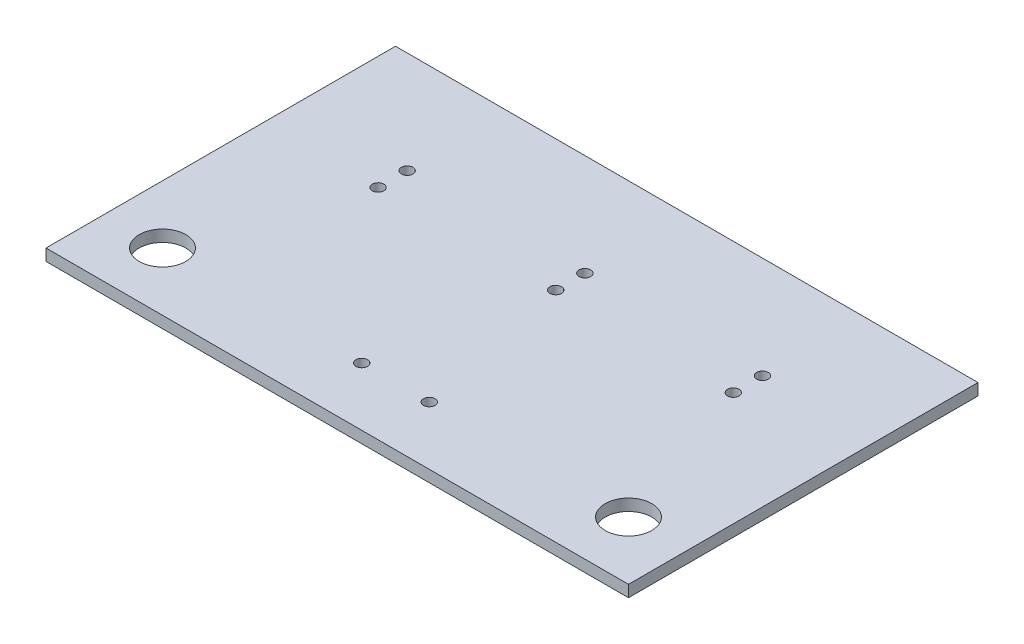
ISO-10303-21;
HEADER;
FILE_DESCRIPTION(('STEP AP214'),'2;1');
FILE_NAME('part.step','',(''),(''),'','','');
FILE_SCHEMA(('AUTOMOTIVE_DESIGN { 1 0 10303 214 1 1 1 1 }'));
ENDSEC;
DATA;
#1=APPLICATION_CONTEXT('core data for automotive mechanical design processes');
#2=APPLICATION_PROTOCOL_DEFINITION('international standard','automotive_design',2000,#1);
#3=PRODUCT_CONTEXT('',#1,'mechanical');
#4=PRODUCT('Part','Part','',(#3));
#5=PRODUCT_RELATED_PRODUCT_CATEGORY('part','',(#4));
#6=PRODUCT_DEFINITION_FORMATION('','',#4);
#7=PRODUCT_DEFINITION_CONTEXT('part definition',#1,'design');
#8=PRODUCT_DEFINITION('design','',#6,#7);
#9=PRODUCT_DEFINITION_SHAPE('','',#8);
#10=(LENGTH_UNIT() NAMED_UNIT(*) SI_UNIT(.MILLI.,.METRE.));
#11=(NAMED_UNIT(*) PLANE_ANGLE_UNIT() SI_UNIT($,.RADIAN.));
#12=(NAMED_UNIT(*) SI_UNIT($,.STERADIAN.) SOLID_ANGLE_UNIT());
#13=UNCERTAINTY_MEASURE_WITH_UNIT(LENGTH_MEASURE(1.E-05),#10,'distance_accuracy_value','');
#14=(GEOMETRIC_REPRESENTATION_CONTEXT(3) GLOBAL_UNCERTAINTY_ASSIGNED_CONTEXT((#13)) GLOBAL_UNIT_ASSIGNED_CONTEXT((#10,
#11,#12)) REPRESENTATION_CONTEXT('',''));
#15=CARTESIAN_POINT('',(0.,0.,0.));
#16=DIRECTION('',(0.,0.,1.));
#17=DIRECTION('',(1.,0.,0.));
#18=AXIS2_PLACEMENT_3D('',#15,#16,#17);
#19=CARTESIAN_POINT('',(0.,1.,0.));
#20=DIRECTION('',(1.,0.,0.));
#21=DIRECTION('',(0.,0.,-1.));
#22=AXIS2_PLACEMENT_3D('',#19,#20,#21);
#23=PLANE('',#22);
#24=DIRECTION('',(0.,0.,1.));
#25=VECTOR('',#24,1.);
#26=CARTESIAN_POINT('',(0.,0.,0.));
#27=LINE('',#26,#25);
#28=CARTESIAN_POINT('',(0.,0.,-30.));
#29=VERTEX_POINT('',#28);
#30=CARTESIAN_POINT('',(0.,0.,0.));
#31=VERTEX_POINT('',#30);
#32=EDGE_CURVE('E95',#29,#31,#27,.T.);
#33=ORIENTED_EDGE('',*,*,#32,.T.);
#34=DIRECTION('',(0.,-1.,0.));
#35=VECTOR('',#34,1.);
#36=CARTESIAN_POINT('',(0.,1.,0.));
#37=LINE('',#36,#35);
#38=CARTESIAN_POINT('',(0.,1.,0.));
#39=VERTEX_POINT('',#38);
#40=EDGE_CURVE('E11',#39,#31,#37,.T.);
#41=ORIENTED_EDGE('',*,*,#40,.F.);
#42=DIRECTION('',(0.,0.,1.));
#43=VECTOR('',#42,1.);
#44=CARTESIAN_POINT('',(0.,1.,0.));
#45=LINE('',#44,#43);
#46=CARTESIAN_POINT('',(0.,1.,-30.));
#47=VERTEX_POINT('',#46);
#48=EDGE_CURVE('E83',#47,#39,#45,.T.);
#49=ORIENTED_EDGE('',*,*,#48,.F.);
#50=DIRECTION('',(0.,-1.,0.));
#51=VECTOR('',#50,1.);
#52=CARTESIAN_POINT('',(0.,1.,-30.));
#53=LINE('',#52,#51);
#54=EDGE_CURVE('E91',#47,#29,#53,.T.);
#55=ORIENTED_EDGE('',*,*,#54,.T.);
#56=EDGE_LOOP('',(#33,#41,#49,#55));
#57=FACE_BOUND('',#56,.T.);
#58=ADVANCED_FACE('F32',(#57),#23,.F.);
#59=CARTESIAN_POINT('',(0.,1.,0.));
#60=DIRECTION('',(0.,0.,-1.));
#61=DIRECTION('',(-1.,0.,0.));
#62=AXIS2_PLACEMENT_3D('',#59,#60,#61);
#63=PLANE('',#62);
#64=DIRECTION('',(1.,0.,0.));
#65=VECTOR('',#64,1.);
#66=CARTESIAN_POINT('',(0.,0.,0.));
#67=LINE('',#66,#65);
#68=CARTESIAN_POINT('',(50.,0.,0.));
#69=VERTEX_POINT('',#68);
#70=EDGE_CURVE('E87',#31,#69,#67,.T.);
#71=ORIENTED_EDGE('',*,*,#70,.T.);
#72=DIRECTION('',(0.,-1.,0.));
#73=VECTOR('',#72,1.);
#74=CARTESIAN_POINT('',(50.,1.,0.));
#75=LINE('',#74,#73);
#76=CARTESIAN_POINT('',(50.,1.,0.));
#77=VERTEX_POINT('',#76);
#78=EDGE_CURVE('E40',#77,#69,#75,.T.);
#79=ORIENTED_EDGE('',*,*,#78,.F.);
#80=DIRECTION('',(1.,0.,0.));
#81=VECTOR('',#80,1.);
#82=CARTESIAN_POINT('',(0.,1.,0.));
#83=LINE('',#82,#81);
#84=EDGE_CURVE('E78',#39,#77,#83,.T.);
#85=ORIENTED_EDGE('',*,*,#84,.F.);
#86=ORIENTED_EDGE('',*,*,#40,.T.);
#87=EDGE_LOOP('',(#71,#79,#85,#86));
#88=FACE_BOUND('',#87,.T.);
#89=ADVANCED_FACE('F86',(#88),#63,.F.);
#90=CARTESIAN_POINT('',(50.,1.,0.));
#91=DIRECTION('',(-1.,0.,0.));
#92=DIRECTION('',(0.,0.,1.));
#93=AXIS2_PLACEMENT_3D('',#90,#91,#92);
#94=PLANE('',#93);
#95=DIRECTION('',(0.,0.,-1.));
#96=VECTOR('',#95,1.);
#97=CARTESIAN_POINT('',(50.,0.,0.));
#98=LINE('',#97,#96);
#99=CARTESIAN_POINT('',(50.,0.,-30.));
#100=VERTEX_POINT('',#99);
#101=EDGE_CURVE('E65',#69,#100,#98,.T.);
#102=ORIENTED_EDGE('',*,*,#101,.T.);
#103=DIRECTION('',(0.,-1.,0.));
#104=VECTOR('',#103,1.);
#105=CARTESIAN_POINT('',(50.,1.,-30.));
#106=LINE('',#105,#104);
#107=CARTESIAN_POINT('',(50.,1.,-30.));
#108=VERTEX_POINT('',#107);
#109=EDGE_CURVE('E88',#108,#100,#106,.T.);
#110=ORIENTED_EDGE('',*,*,#109,.F.);
#111=DIRECTION('',(0.,0.,-1.));
#112=VECTOR('',#111,1.);
#113=CARTESIAN_POINT('',(50.,1.,0.));
#114=LINE('',#113,#112);
#115=EDGE_CURVE('E81',#77,#108,#114,.T.);
#116=ORIENTED_EDGE('',*,*,#115,.F.);
#117=ORIENTED_EDGE('',*,*,#78,.T.);
#118=EDGE_LOOP('',(#102,#110,#116,#117));
#119=FACE_BOUND('',#118,.T.);
#120=ADVANCED_FACE('F89',(#119),#94,.F.);
#121=CARTESIAN_POINT('',(0.,1.,-30.));
#122=DIRECTION('',(0.,0.,1.));
#123=DIRECTION('',(1.,0.,0.));
#124=AXIS2_PLACEMENT_3D('',#121,#122,#123);
#125=PLANE('',#124);
#126=DIRECTION('',(-1.,0.,0.));
#127=VECTOR('',#126,1.);
#128=CARTESIAN_POINT('',(0.,0.,-30.));
#129=LINE('',#128,#127);
#130=EDGE_CURVE('E71',#100,#29,#129,.T.);
#131=ORIENTED_EDGE('',*,*,#130,.T.);
#132=ORIENTED_EDGE('',*,*,#54,.F.);
#133=DIRECTION('',(-1.,0.,0.));
#134=VECTOR('',#133,1.);
#135=CARTESIAN_POINT('',(0.,1.,-30.));
#136=LINE('',#135,#134);
#137=EDGE_CURVE('E48',#108,#47,#136,.T.);
#138=ORIENTED_EDGE('',*,*,#137,.F.);
#139=ORIENTED_EDGE('',*,*,#109,.T.);
#140=EDGE_LOOP('',(#131,#132,#138,#139));
#141=FACE_BOUND('',#140,.T.);
#142=ADVANCED_FACE('F103',(#141),#125,.F.);
#143=CARTESIAN_POINT('',(0.,1.,0.));
#144=DIRECTION('',(0.,-1.,0.));
#145=DIRECTION('',(0.,0.,-1.));
#146=AXIS2_PLACEMENT_3D('',#143,#144,#145);
#147=PLANE('',#146);
#148=CARTESIAN_POINT('',(5.,1.,-5.));
#149=DIRECTION('',(0.,1.,0.));
#150=DIRECTION('',(0.,0.,1.));
#151=AXIS2_PLACEMENT_3D('',#148,#149,#150);
#152=CIRCLE('',#151,2.);
#153=CARTESIAN_POINT('',(5.,1.,-3.));
#154=VERTEX_POINT('',#153);
#155=EDGE_CURVE('E163',#154,#154,#152,.T.);
#156=ORIENTED_EDGE('',*,*,#155,.F.);
#157=EDGE_LOOP('',(#156));
#158=FACE_BOUND('',#157,.T.);
#159=CARTESIAN_POINT('',(45.,1.,-5.));
#160=DIRECTION('',(0.,1.,0.));
#161=DIRECTION('',(0.,0.,1.));
#162=AXIS2_PLACEMENT_3D('',#159,#160,#161);
#163=CIRCLE('',#162,2.);
#164=CARTESIAN_POINT('',(45.,1.,-3.));
#165=VERTEX_POINT('',#164);
#166=EDGE_CURVE('E157',#165,#165,#163,.T.);
#167=ORIENTED_EDGE('',*,*,#166,.F.);
#168=EDGE_LOOP('',(#167));
#169=FACE_BOUND('',#168,.T.);
#170=CARTESIAN_POINT('',(40.25,1.,-21.25));
#171=DIRECTION('',(0.,1.,0.));
#172=DIRECTION('',(0.,0.,1.));
#173=AXIS2_PLACEMENT_3D('',#170,#171,#172);
#174=CIRCLE('',#173,0.499999999999999);
#175=CARTESIAN_POINT('',(40.25,1.,-20.75));
#176=VERTEX_POINT('',#175);
#177=EDGE_CURVE('E151',#176,#176,#174,.T.);
#178=ORIENTED_EDGE('',*,*,#177,.F.);
#179=EDGE_LOOP('',(#178));
#180=FACE_BOUND('',#179,.T.);
#181=CARTESIAN_POINT('',(40.25,1.,-18.75));
#182=DIRECTION('',(0.,1.,0.));
#183=DIRECTION('',(0.,0.,1.));
#184=AXIS2_PLACEMENT_3D('',#181,#182,#183);
#185=CIRCLE('',#184,0.499999999999999);
#186=CARTESIAN_POINT('',(40.25,1.,-18.25));
#187=VERTEX_POINT('',#186);
#188=EDGE_CURVE('E145',#187,#187,#185,.T.);
#189=ORIENTED_EDGE('',*,*,#188,.F.);
#190=EDGE_LOOP('',(#189));
#191=FACE_BOUND('',#190,.T.);
#192=CARTESIAN_POINT('',(25.,1.,-21.25));
#193=DIRECTION('',(0.,1.,0.));
#194=DIRECTION('',(0.,0.,1.));
#195=AXIS2_PLACEMENT_3D('',#192,#193,#194);
#196=CIRCLE('',#195,0.499999999999999);
#197=CARTESIAN_POINT('',(25.,1.,-20.75));
#198=VERTEX_POINT('',#197);
#199=EDGE_CURVE('E139',#198,#198,#196,.T.);
#200=ORIENTED_EDGE('',*,*,#199,.F.);
#201=EDGE_LOOP('',(#200));
#202=FACE_BOUND('',#201,.T.);
#203=CARTESIAN_POINT('',(25.,1.,-18.75));
#204=DIRECTION('',(0.,1.,0.));
#205=DIRECTION('',(0.,0.,1.));
#206=AXIS2_PLACEMENT_3D('',#203,#204,#205);
#207=CIRCLE('',#206,0.499999999999999);
#208=CARTESIAN_POINT('',(25.,1.,-18.25));
#209=VERTEX_POINT('',#208);
#210=EDGE_CURVE('E133',#209,#209,#207,.T.);
#211=ORIENTED_EDGE('',*,*,#210,.F.);
#212=EDGE_LOOP('',(#211));
#213=FACE_BOUND('',#212,.T.);
#214=CARTESIAN_POINT('',(9.75,1.,-21.25));
#215=DIRECTION('',(0.,1.,0.));
#216=DIRECTION('',(0.,0.,1.));
#217=AXIS2_PLACEMENT_3D('',#214,#215,#216);
#218=CIRCLE('',#217,0.500000000000001);
#219=CARTESIAN_POINT('',(9.75,1.,-20.75));
#220=VERTEX_POINT('',#219);
#221=EDGE_CURVE('E127',#220,#220,#218,.T.);
#222=ORIENTED_EDGE('',*,*,#221,.F.);
#223=EDGE_LOOP('',(#222));
#224=FACE_BOUND('',#223,.T.);
#225=CARTESIAN_POINT('',(9.75,1.,-18.75));
#226=DIRECTION('',(0.,1.,0.));
#227=DIRECTION('',(0.,0.,1.));
#228=AXIS2_PLACEMENT_3D('',#225,#226,#227);
#229=CIRCLE('',#228,0.500000000000001);
#230=CARTESIAN_POINT('',(9.75,1.,-18.25));
#231=VERTEX_POINT('',#230);
#232=EDGE_CURVE('E121',#231,#231,#229,.T.);
#233=ORIENTED_EDGE('',*,*,#232,.F.);
#234=EDGE_LOOP('',(#233));
#235=FACE_BOUND('',#234,.T.);
#236=CARTESIAN_POINT('',(27.9,1.,-5.));
#237=DIRECTION('',(0.,1.,0.));
#238=DIRECTION('',(0.,0.,1.));
#239=AXIS2_PLACEMENT_3D('',#236,#237,#238);
#240=CIRCLE('',#239,0.499999999999999);
#241=CARTESIAN_POINT('',(27.9,1.,-4.5));
#242=VERTEX_POINT('',#241);
#243=EDGE_CURVE('E115',#242,#242,#240,.T.);
#244=ORIENTED_EDGE('',*,*,#243,.F.);
#245=EDGE_LOOP('',(#244));
#246=FACE_BOUND('',#245,.T.);
#247=CARTESIAN_POINT('',(22.1,1.,-5.));
#248=DIRECTION('',(0.,1.,0.));
#249=DIRECTION('',(0.,0.,1.));
#250=AXIS2_PLACEMENT_3D('',#247,#248,#249);
#251=CIRCLE('',#250,0.499999999999999);
#252=CARTESIAN_POINT('',(22.1,1.,-4.5));
#253=VERTEX_POINT('',#252);
#254=EDGE_CURVE('E109',#253,#253,#251,.T.);
#255=ORIENTED_EDGE('',*,*,#254,.F.);
#256=EDGE_LOOP('',(#255));
#257=FACE_BOUND('',#256,.T.);
#258=ORIENTED_EDGE('',*,*,#48,.T.);
#259=ORIENTED_EDGE('',*,*,#84,.T.);
#260=ORIENTED_EDGE('',*,*,#115,.T.);
#261=ORIENTED_EDGE('',*,*,#137,.T.);
#262=EDGE_LOOP('',(#258,#259,#260,#261));
#263=FACE_BOUND('',#262,.T.);
#264=ADVANCED_FACE('F79',(#158,#169,#180,#191,#202,#213,#224,#235,#246,#257,#263),#147,.F.);
#265=CARTESIAN_POINT('',(0.,0.,0.));
#266=DIRECTION('',(0.,-1.,0.));
#267=DIRECTION('',(0.,0.,-1.));
#268=AXIS2_PLACEMENT_3D('',#265,#266,#267);
#269=PLANE('',#268);
#270=CARTESIAN_POINT('',(5.,0.,-5.));
#271=DIRECTION('',(0.,1.,0.));
#272=DIRECTION('',(0.,0.,1.));
#273=AXIS2_PLACEMENT_3D('',#270,#271,#272);
#274=CIRCLE('',#273,2.);
#275=CARTESIAN_POINT('',(5.,0.,-3.));
#276=VERTEX_POINT('',#275);
#277=EDGE_CURVE('E160',#276,#276,#274,.T.);
#278=ORIENTED_EDGE('',*,*,#277,.T.);
#279=EDGE_LOOP('',(#278));
#280=FACE_BOUND('',#279,.T.);
#281=CARTESIAN_POINT('',(45.,0.,-5.));
#282=DIRECTION('',(0.,1.,0.));
#283=DIRECTION('',(0.,0.,1.));
#284=AXIS2_PLACEMENT_3D('',#281,#282,#283);
#285=CIRCLE('',#284,2.);
#286=CARTESIAN_POINT('',(45.,0.,-3.));
#287=VERTEX_POINT('',#286);
#288=EDGE_CURVE('E154',#287,#287,#285,.T.);
#289=ORIENTED_EDGE('',*,*,#288,.T.);
#290=EDGE_LOOP('',(#289));
#291=FACE_BOUND('',#290,.T.);
#292=CARTESIAN_POINT('',(40.25,0.,-21.25));
#293=DIRECTION('',(0.,1.,0.));
#294=DIRECTION('',(0.,0.,1.));
#295=AXIS2_PLACEMENT_3D('',#292,#293,#294);
#296=CIRCLE('',#295,0.499999999999999);
#297=CARTESIAN_POINT('',(40.25,0.,-20.75));
#298=VERTEX_POINT('',#297);
#299=EDGE_CURVE('E148',#298,#298,#296,.T.);
#300=ORIENTED_EDGE('',*,*,#299,.T.);
#301=EDGE_LOOP('',(#300));
#302=FACE_BOUND('',#301,.T.);
#303=CARTESIAN_POINT('',(40.25,0.,-18.75));
#304=DIRECTION('',(0.,1.,0.));
#305=DIRECTION('',(0.,0.,1.));
#306=AXIS2_PLACEMENT_3D('',#303,#304,#305);
#307=CIRCLE('',#306,0.499999999999999);
#308=CARTESIAN_POINT('',(40.25,0.,-18.25));
#309=VERTEX_POINT('',#308);
#310=EDGE_CURVE('E142',#309,#309,#307,.T.);
#311=ORIENTED_EDGE('',*,*,#310,.T.);
#312=EDGE_LOOP('',(#311));
#313=FACE_BOUND('',#312,.T.);
#314=CARTESIAN_POINT('',(25.,0.,-21.25));
#315=DIRECTION('',(0.,1.,0.));
#316=DIRECTION('',(0.,0.,1.));
#317=AXIS2_PLACEMENT_3D('',#314,#315,#316);
#318=CIRCLE('',#317,0.499999999999999);
#319=CARTESIAN_POINT('',(25.,0.,-20.75));
#320=VERTEX_POINT('',#319);
#321=EDGE_CURVE('E136',#320,#320,#318,.T.);
#322=ORIENTED_EDGE('',*,*,#321,.T.);
#323=EDGE_LOOP('',(#322));
#324=FACE_BOUND('',#323,.T.);
#325=CARTESIAN_POINT('',(25.,0.,-18.75));
#326=DIRECTION('',(0.,1.,0.));
#327=DIRECTION('',(0.,0.,1.));
#328=AXIS2_PLACEMENT_3D('',#325,#326,#327);
#329=CIRCLE('',#328,0.499999999999999);
#330=CARTESIAN_POINT('',(25.,0.,-18.25));
#331=VERTEX_POINT('',#330);
#332=EDGE_CURVE('E130',#331,#331,#329,.T.);
#333=ORIENTED_EDGE('',*,*,#332,.T.);
#334=EDGE_LOOP('',(#333));
#335=FACE_BOUND('',#334,.T.);
#336=CARTESIAN_POINT('',(9.75,0.,-21.25));
#337=DIRECTION('',(0.,1.,0.));
#338=DIRECTION('',(0.,0.,1.));
#339=AXIS2_PLACEMENT_3D('',#336,#337,#338);
#340=CIRCLE('',#339,0.500000000000001);
#341=CARTESIAN_POINT('',(9.75,0.,-20.75));
#342=VERTEX_POINT('',#341);
#343=EDGE_CURVE('E124',#342,#342,#340,.T.);
#344=ORIENTED_EDGE('',*,*,#343,.T.);
#345=EDGE_LOOP('',(#344));
#346=FACE_BOUND('',#345,.T.);
#347=CARTESIAN_POINT('',(9.75,0.,-18.75));
#348=DIRECTION('',(0.,1.,0.));
#349=DIRECTION('',(0.,0.,1.));
#350=AXIS2_PLACEMENT_3D('',#347,#348,#349);
#351=CIRCLE('',#350,0.500000000000001);
#352=CARTESIAN_POINT('',(9.75,0.,-18.25));
#353=VERTEX_POINT('',#352);
#354=EDGE_CURVE('E118',#353,#353,#351,.T.);
#355=ORIENTED_EDGE('',*,*,#354,.T.);
#356=EDGE_LOOP('',(#355));
#357=FACE_BOUND('',#356,.T.);
#358=CARTESIAN_POINT('',(27.9,0.,-5.));
#359=DIRECTION('',(0.,1.,0.));
#360=DIRECTION('',(0.,0.,1.));
#361=AXIS2_PLACEMENT_3D('',#358,#359,#360);
#362=CIRCLE('',#361,0.499999999999999);
#363=CARTESIAN_POINT('',(27.9,0.,-4.5));
#364=VERTEX_POINT('',#363);
#365=EDGE_CURVE('E112',#364,#364,#362,.T.);
#366=ORIENTED_EDGE('',*,*,#365,.T.);
#367=EDGE_LOOP('',(#366));
#368=FACE_BOUND('',#367,.T.);
#369=CARTESIAN_POINT('',(22.1,0.,-5.));
#370=DIRECTION('',(0.,1.,0.));
#371=DIRECTION('',(0.,0.,1.));
#372=AXIS2_PLACEMENT_3D('',#369,#370,#371);
#373=CIRCLE('',#372,0.499999999999999);
#374=CARTESIAN_POINT('',(22.1,0.,-4.5));
#375=VERTEX_POINT('',#374);
#376=EDGE_CURVE('E98',#375,#375,#373,.T.);
#377=ORIENTED_EDGE('',*,*,#376,.T.);
#378=EDGE_LOOP('',(#377));
#379=FACE_BOUND('',#378,.T.);
#380=ORIENTED_EDGE('',*,*,#32,.F.);
#381=ORIENTED_EDGE('',*,*,#130,.F.);
#382=ORIENTED_EDGE('',*,*,#101,.F.);
#383=ORIENTED_EDGE('',*,*,#70,.F.);
#384=EDGE_LOOP('',(#380,#381,#382,#383));
#385=FACE_BOUND('',#384,.T.);
#386=ADVANCED_FACE('F106',(#280,#291,#302,#313,#324,#335,#346,#357,#368,#379,#385),#269,.T.);
#387=CARTESIAN_POINT('',(22.1,0.,-5.));
#388=DIRECTION('',(0.,1.,0.));
#389=DIRECTION('',(0.,0.,1.));
#390=AXIS2_PLACEMENT_3D('',#387,#388,#389);
#391=CYLINDRICAL_SURFACE('',#390,0.499999999999999);
#392=ORIENTED_EDGE('',*,*,#376,.F.);
#393=EDGE_LOOP('',(#392));
#394=FACE_BOUND('',#393,.T.);
#395=ORIENTED_EDGE('',*,*,#254,.T.);
#396=EDGE_LOOP('',(#395));
#397=FACE_BOUND('',#396,.T.);
#398=ADVANCED_FACE('F199',(#394,#397),#391,.F.);
#399=CARTESIAN_POINT('',(27.9,0.,-5.));
#400=DIRECTION('',(0.,1.,0.));
#401=DIRECTION('',(0.,0.,1.));
#402=AXIS2_PLACEMENT_3D('',#399,#400,#401);
#403=CYLINDRICAL_SURFACE('',#402,0.499999999999999);
#404=ORIENTED_EDGE('',*,*,#365,.F.);
#405=EDGE_LOOP('',(#404));
#406=FACE_BOUND('',#405,.T.);
#407=ORIENTED_EDGE('',*,*,#243,.T.);
#408=EDGE_LOOP('',(#407));
#409=FACE_BOUND('',#408,.T.);
#410=ADVANCED_FACE('F201',(#406,#409),#403,.F.);
#411=CARTESIAN_POINT('',(9.75,0.,-18.75));
#412=DIRECTION('',(0.,1.,0.));
#413=DIRECTION('',(0.,0.,1.));
#414=AXIS2_PLACEMENT_3D('',#411,#412,#413);
#415=CYLINDRICAL_SURFACE('',#414,0.500000000000001);
#416=ORIENTED_EDGE('',*,*,#354,.F.);
#417=EDGE_LOOP('',(#416));
#418=FACE_BOUND('',#417,.T.);
#419=ORIENTED_EDGE('',*,*,#232,.T.);
#420=EDGE_LOOP('',(#419));
#421=FACE_BOUND('',#420,.T.);
#422=ADVANCED_FACE('F208',(#418,#421),#415,.F.);
#423=CARTESIAN_POINT('',(9.75,0.,-21.25));
#424=DIRECTION('',(0.,1.,0.));
#425=DIRECTION('',(0.,0.,1.));
#426=AXIS2_PLACEMENT_3D('',#423,#424,#425);
#427=CYLINDRICAL_SURFACE('',#426,0.500000000000001);
#428=ORIENTED_EDGE('',*,*,#343,.F.);
#429=EDGE_LOOP('',(#428));
#430=FACE_BOUND('',#429,.T.);
#431=ORIENTED_EDGE('',*,*,#221,.T.);
#432=EDGE_LOOP('',(#431));
#433=FACE_BOUND('',#432,.T.);
#434=ADVANCED_FACE('F254',(#430,#433),#427,.F.);
#435=CARTESIAN_POINT('',(25.,0.,-18.75));
#436=DIRECTION('',(0.,1.,0.));
#437=DIRECTION('',(0.,0.,1.));
#438=AXIS2_PLACEMENT_3D('',#435,#436,#437);
#439=CYLINDRICAL_SURFACE('',#438,0.499999999999999);
#440=ORIENTED_EDGE('',*,*,#332,.F.);
#441=EDGE_LOOP('',(#440));
#442=FACE_BOUND('',#441,.T.);
#443=ORIENTED_EDGE('',*,*,#210,.T.);
#444=EDGE_LOOP('',(#443));
#445=FACE_BOUND('',#444,.T.);
#446=ADVANCED_FACE('F264',(#442,#445),#439,.F.);
#447=CARTESIAN_POINT('',(25.,0.,-21.25));
#448=DIRECTION('',(0.,1.,0.));
#449=DIRECTION('',(0.,0.,1.));
#450=AXIS2_PLACEMENT_3D('',#447,#448,#449);
#451=CYLINDRICAL_SURFACE('',#450,0.499999999999999);
#452=ORIENTED_EDGE('',*,*,#321,.F.);
#453=EDGE_LOOP('',(#452));
#454=FACE_BOUND('',#453,.T.);
#455=ORIENTED_EDGE('',*,*,#199,.T.);
#456=EDGE_LOOP('',(#455));
#457=FACE_BOUND('',#456,.T.);
#458=ADVANCED_FACE('F274',(#454,#457),#451,.F.);
#459=CARTESIAN_POINT('',(40.25,0.,-18.75));
#460=DIRECTION('',(0.,1.,0.));
#461=DIRECTION('',(0.,0.,1.));
#462=AXIS2_PLACEMENT_3D('',#459,#460,#461);
#463=CYLINDRICAL_SURFACE('',#462,0.499999999999999);
#464=ORIENTED_EDGE('',*,*,#310,.F.);
#465=EDGE_LOOP('',(#464));
#466=FACE_BOUND('',#465,.T.);
#467=ORIENTED_EDGE('',*,*,#188,.T.);
#468=EDGE_LOOP('',(#467));
#469=FACE_BOUND('',#468,.T.);
#470=ADVANCED_FACE('F284',(#466,#469),#463,.F.);
#471=CARTESIAN_POINT('',(40.25,0.,-21.25));
#472=DIRECTION('',(0.,1.,0.));
#473=DIRECTION('',(0.,0.,1.));
#474=AXIS2_PLACEMENT_3D('',#471,#472,#473);
#475=CYLINDRICAL_SURFACE('',#474,0.499999999999999);
#476=ORIENTED_EDGE('',*,*,#299,.F.);
#477=EDGE_LOOP('',(#476));
#478=FACE_BOUND('',#477,.T.);
#479=ORIENTED_EDGE('',*,*,#177,.T.);
#480=EDGE_LOOP('',(#479));
#481=FACE_BOUND('',#480,.T.);
#482=ADVANCED_FACE('F294',(#478,#481),#475,.F.);
#483=CARTESIAN_POINT('',(45.,0.,-5.));
#484=DIRECTION('',(0.,1.,0.));
#485=DIRECTION('',(0.,0.,1.));
#486=AXIS2_PLACEMENT_3D('',#483,#484,#485);
#487=CYLINDRICAL_SURFACE('',#486,2.);
#488=ORIENTED_EDGE('',*,*,#288,.F.);
#489=EDGE_LOOP('',(#488));
#490=FACE_BOUND('',#489,.T.);
#491=ORIENTED_EDGE('',*,*,#166,.T.);
#492=EDGE_LOOP('',(#491));
#493=FACE_BOUND('',#492,.T.);
#494=ADVANCED_FACE('F174',(#490,#493),#487,.F.);
#495=CARTESIAN_POINT('',(5.,0.,-5.));
#496=DIRECTION('',(0.,1.,0.));
#497=DIRECTION('',(0.,0.,1.));
#498=AXIS2_PLACEMENT_3D('',#495,#496,#497);
#499=CYLINDRICAL_SURFACE('',#498,2.);
#500=ORIENTED_EDGE('',*,*,#277,.F.);
#501=EDGE_LOOP('',(#500));
#502=FACE_BOUND('',#501,.T.);
#503=ORIENTED_EDGE('',*,*,#155,.T.);
#504=EDGE_LOOP('',(#503));
#505=FACE_BOUND('',#504,.T.);
#506=ADVANCED_FACE('F171',(#502,#505),#499,.F.);
#507=CLOSED_SHELL('',(#58,#89,#120,#142,#264,#386,#398,#410,#422,#434,#446,#458,#470,#482,#494,#506));
#508=MANIFOLD_SOLID_BREP('B2',#507);
#509=ADVANCED_BREP_SHAPE_REPRESENTATION('',(#18,#508),#14);
#510=SHAPE_DEFINITION_REPRESENTATION(#9,#509);
ENDSEC;
END-ISO-10303-21;
